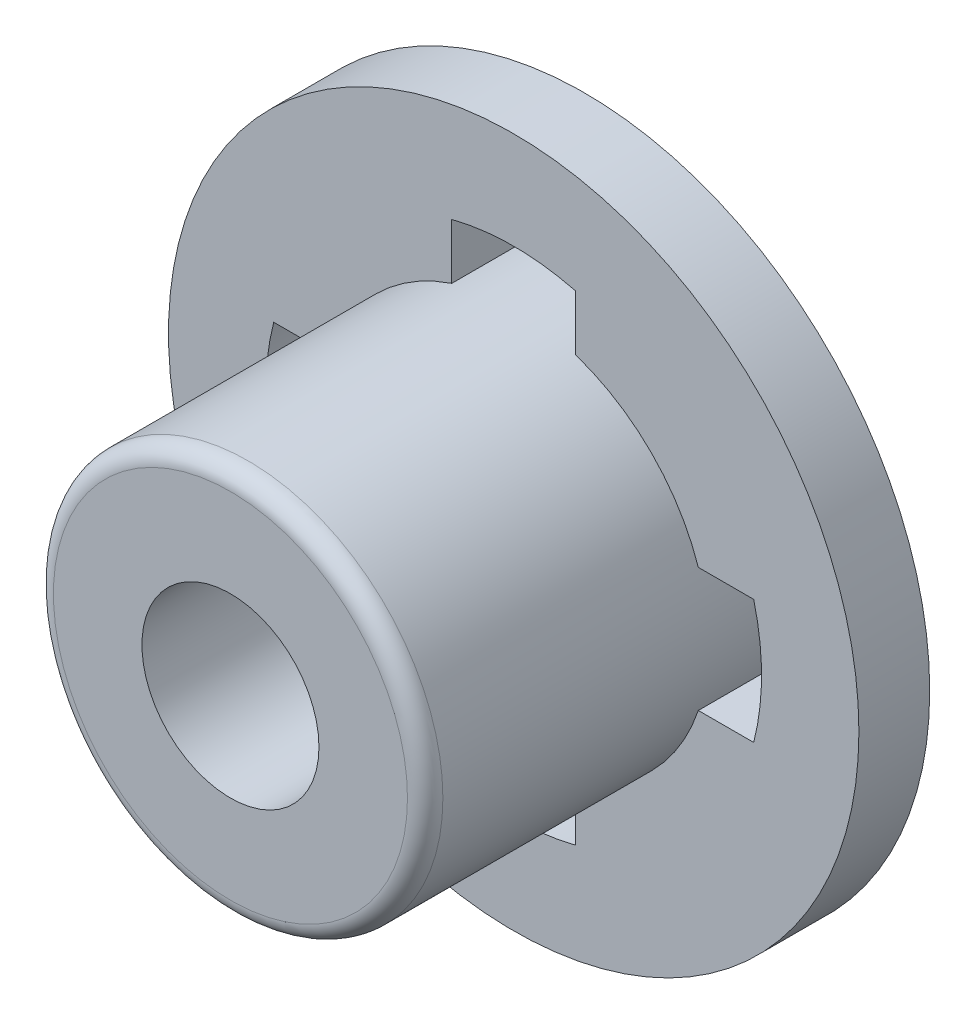
ISO-10303-21;
HEADER;
FILE_DESCRIPTION(('STEP AP214'),'2;1');
FILE_NAME('part.step','',(''),(''),'','','');
FILE_SCHEMA(('AUTOMOTIVE_DESIGN { 1 0 10303 214 1 1 1 1 }'));
ENDSEC;
DATA;
#1=APPLICATION_CONTEXT('core data for automotive mechanical design processes');
#2=APPLICATION_PROTOCOL_DEFINITION('international standard','automotive_design',2000,#1);
#3=PRODUCT_CONTEXT('',#1,'mechanical');
#4=PRODUCT('Part','Part','',(#3));
#5=PRODUCT_RELATED_PRODUCT_CATEGORY('part','',(#4));
#6=PRODUCT_DEFINITION_FORMATION('','',#4);
#7=PRODUCT_DEFINITION_CONTEXT('part definition',#1,'design');
#8=PRODUCT_DEFINITION('design','',#6,#7);
#9=PRODUCT_DEFINITION_SHAPE('','',#8);
#10=(LENGTH_UNIT() NAMED_UNIT(*) SI_UNIT(.MILLI.,.METRE.));
#11=(NAMED_UNIT(*) PLANE_ANGLE_UNIT() SI_UNIT($,.RADIAN.));
#12=(NAMED_UNIT(*) SI_UNIT($,.STERADIAN.) SOLID_ANGLE_UNIT());
#13=UNCERTAINTY_MEASURE_WITH_UNIT(LENGTH_MEASURE(1.E-05),#10,'distance_accuracy_value','');
#14=(GEOMETRIC_REPRESENTATION_CONTEXT(3) GLOBAL_UNCERTAINTY_ASSIGNED_CONTEXT((#13)) GLOBAL_UNIT_ASSIGNED_CONTEXT((#10,
#11,#12)) REPRESENTATION_CONTEXT('',''));
#15=CARTESIAN_POINT('',(0.,0.,0.));
#16=DIRECTION('',(0.,0.,1.));
#17=DIRECTION('',(1.,0.,0.));
#18=AXIS2_PLACEMENT_3D('',#15,#16,#17);
#19=CARTESIAN_POINT('',(0.,0.,-0.8));
#20=DIRECTION('',(0.,0.,1.));
#21=DIRECTION('',(1.,0.,0.));
#22=AXIS2_PLACEMENT_3D('',#19,#20,#21);
#23=PLANE('',#22);
#24=CARTESIAN_POINT('',(0.,0.,-0.8));
#25=DIRECTION('',(0.,0.,-1.));
#26=DIRECTION('',(-1.,0.,0.));
#27=AXIS2_PLACEMENT_3D('',#24,#25,#26);
#28=CIRCLE('',#27,2.2);
#29=CARTESIAN_POINT('',(2.08566536146142,0.7,-0.8));
#30=VERTEX_POINT('',#29);
#31=CARTESIAN_POINT('',(2.08566536146142,-0.7,-0.8));
#32=VERTEX_POINT('',#31);
#33=EDGE_CURVE('E58',#30,#32,#28,.T.);
#34=ORIENTED_EDGE('',*,*,#33,.T.);
#35=DIRECTION('',(-1.,0.,0.));
#36=VECTOR('',#35,1.);
#37=CARTESIAN_POINT('',(0.,-0.7,-0.8));
#38=LINE('',#37,#36);
#39=CARTESIAN_POINT('',(2.71108834234519,-0.7,-0.8));
#40=VERTEX_POINT('',#39);
#41=EDGE_CURVE('E195',#40,#32,#38,.T.);
#42=ORIENTED_EDGE('',*,*,#41,.F.);
#43=CARTESIAN_POINT('',(0.,0.,-0.8));
#44=DIRECTION('',(0.,0.,-1.));
#45=DIRECTION('',(-1.,0.,0.));
#46=AXIS2_PLACEMENT_3D('',#43,#44,#45);
#47=CIRCLE('',#46,2.8);
#48=CARTESIAN_POINT('',(2.71108834234519,0.7,-0.8));
#49=VERTEX_POINT('',#48);
#50=EDGE_CURVE('E192',#49,#40,#47,.T.);
#51=ORIENTED_EDGE('',*,*,#50,.F.);
#52=DIRECTION('',(-1.,0.,0.));
#53=VECTOR('',#52,1.);
#54=CARTESIAN_POINT('',(0.,0.7,-0.8));
#55=LINE('',#54,#53);
#56=EDGE_CURVE('E189',#49,#30,#55,.T.);
#57=ORIENTED_EDGE('',*,*,#56,.T.);
#58=EDGE_LOOP('',(#34,#42,#51,#57));
#59=FACE_BOUND('',#58,.T.);
#60=CARTESIAN_POINT('',(0.,0.,-0.8));
#61=DIRECTION('',(0.,0.,-1.));
#62=DIRECTION('',(-1.,0.,0.));
#63=AXIS2_PLACEMENT_3D('',#60,#61,#62);
#64=CIRCLE('',#63,2.2);
#65=CARTESIAN_POINT('',(-0.7,2.08566536146142,-0.8));
#66=VERTEX_POINT('',#65);
#67=CARTESIAN_POINT('',(0.7,2.08566536146142,-0.8));
#68=VERTEX_POINT('',#67);
#69=EDGE_CURVE('E240',#66,#68,#64,.T.);
#70=ORIENTED_EDGE('',*,*,#69,.T.);
#71=DIRECTION('',(0.,1.,0.));
#72=VECTOR('',#71,1.);
#73=CARTESIAN_POINT('',(0.7,0.,-0.8));
#74=LINE('',#73,#72);
#75=CARTESIAN_POINT('',(0.7,2.71108834234519,-0.8));
#76=VERTEX_POINT('',#75);
#77=EDGE_CURVE('E249',#68,#76,#74,.T.);
#78=ORIENTED_EDGE('',*,*,#77,.T.);
#79=CARTESIAN_POINT('',(0.,0.,-0.8));
#80=DIRECTION('',(0.,0.,-1.));
#81=DIRECTION('',(-1.,0.,0.));
#82=AXIS2_PLACEMENT_3D('',#79,#80,#81);
#83=CIRCLE('',#82,2.8);
#84=CARTESIAN_POINT('',(-0.7,2.71108834234519,-0.8));
#85=VERTEX_POINT('',#84);
#86=EDGE_CURVE('E246',#85,#76,#83,.T.);
#87=ORIENTED_EDGE('',*,*,#86,.F.);
#88=DIRECTION('',(0.,1.,0.));
#89=VECTOR('',#88,1.);
#90=CARTESIAN_POINT('',(-0.7,0.,-0.8));
#91=LINE('',#90,#89);
#92=EDGE_CURVE('E243',#66,#85,#91,.T.);
#93=ORIENTED_EDGE('',*,*,#92,.F.);
#94=EDGE_LOOP('',(#70,#78,#87,#93));
#95=FACE_BOUND('',#94,.T.);
#96=CARTESIAN_POINT('',(0.,0.,-0.8));
#97=DIRECTION('',(0.,0.,-1.));
#98=DIRECTION('',(-1.,0.,0.));
#99=AXIS2_PLACEMENT_3D('',#96,#97,#98);
#100=CIRCLE('',#99,1.15);
#101=CARTESIAN_POINT('',(-1.15,0.,-0.8));
#102=VERTEX_POINT('',#101);
#103=EDGE_CURVE('E264',#102,#102,#100,.T.);
#104=ORIENTED_EDGE('',*,*,#103,.F.);
#105=EDGE_LOOP('',(#104));
#106=FACE_BOUND('',#105,.T.);
#107=CARTESIAN_POINT('',(0.,0.,-0.8));
#108=DIRECTION('',(0.,0.,1.));
#109=DIRECTION('',(1.,0.,0.));
#110=AXIS2_PLACEMENT_3D('',#107,#108,#109);
#111=CIRCLE('',#110,3.9);
#112=CARTESIAN_POINT('',(3.9,0.,-0.8));
#113=VERTEX_POINT('',#112);
#114=EDGE_CURVE('E279',#113,#113,#111,.T.);
#115=ORIENTED_EDGE('',*,*,#114,.F.);
#116=EDGE_LOOP('',(#115));
#117=FACE_BOUND('',#116,.T.);
#118=CARTESIAN_POINT('',(0.,0.,-0.8));
#119=DIRECTION('',(0.,0.,-1.));
#120=DIRECTION('',(-1.,0.,0.));
#121=AXIS2_PLACEMENT_3D('',#118,#119,#120);
#122=CIRCLE('',#121,2.2);
#123=CARTESIAN_POINT('',(-2.08566536146142,-0.7,-0.8));
#124=VERTEX_POINT('',#123);
#125=CARTESIAN_POINT('',(-2.08566536146142,0.7,-0.8));
#126=VERTEX_POINT('',#125);
#127=EDGE_CURVE('E213',#124,#126,#122,.T.);
#128=ORIENTED_EDGE('',*,*,#127,.T.);
#129=DIRECTION('',(-1.,0.,0.));
#130=VECTOR('',#129,1.);
#131=CARTESIAN_POINT('',(0.,0.7,-0.8));
#132=LINE('',#131,#130);
#133=CARTESIAN_POINT('',(-2.71108834234519,0.7,-0.8));
#134=VERTEX_POINT('',#133);
#135=EDGE_CURVE('E222',#126,#134,#132,.T.);
#136=ORIENTED_EDGE('',*,*,#135,.T.);
#137=CARTESIAN_POINT('',(0.,0.,-0.8));
#138=DIRECTION('',(0.,0.,-1.));
#139=DIRECTION('',(-1.,0.,0.));
#140=AXIS2_PLACEMENT_3D('',#137,#138,#139);
#141=CIRCLE('',#140,2.8);
#142=CARTESIAN_POINT('',(-2.71108834234519,-0.7,-0.8));
#143=VERTEX_POINT('',#142);
#144=EDGE_CURVE('E219',#143,#134,#141,.T.);
#145=ORIENTED_EDGE('',*,*,#144,.F.);
#146=DIRECTION('',(-1.,0.,0.));
#147=VECTOR('',#146,1.);
#148=CARTESIAN_POINT('',(0.,-0.7,-0.8));
#149=LINE('',#148,#147);
#150=EDGE_CURVE('E216',#124,#143,#149,.T.);
#151=ORIENTED_EDGE('',*,*,#150,.F.);
#152=EDGE_LOOP('',(#128,#136,#145,#151));
#153=FACE_BOUND('',#152,.T.);
#154=CARTESIAN_POINT('',(0.,0.,-0.8));
#155=DIRECTION('',(0.,0.,-1.));
#156=DIRECTION('',(-1.,0.,0.));
#157=AXIS2_PLACEMENT_3D('',#154,#155,#156);
#158=CIRCLE('',#157,2.2);
#159=CARTESIAN_POINT('',(0.7,-2.08566536146142,-0.8));
#160=VERTEX_POINT('',#159);
#161=CARTESIAN_POINT('',(-0.7,-2.08566536146142,-0.8));
#162=VERTEX_POINT('',#161);
#163=EDGE_CURVE('E51',#160,#162,#158,.T.);
#164=ORIENTED_EDGE('',*,*,#163,.T.);
#165=DIRECTION('',(0.,1.,0.));
#166=VECTOR('',#165,1.);
#167=CARTESIAN_POINT('',(-0.7,0.,-0.8));
#168=LINE('',#167,#166);
#169=CARTESIAN_POINT('',(-0.7,-2.71108834234519,-0.8));
#170=VERTEX_POINT('',#169);
#171=EDGE_CURVE('E169',#170,#162,#168,.T.);
#172=ORIENTED_EDGE('',*,*,#171,.F.);
#173=CARTESIAN_POINT('',(0.,0.,-0.8));
#174=DIRECTION('',(0.,0.,-1.));
#175=DIRECTION('',(-1.,0.,0.));
#176=AXIS2_PLACEMENT_3D('',#173,#174,#175);
#177=CIRCLE('',#176,2.8);
#178=CARTESIAN_POINT('',(0.7,-2.71108834234519,-0.8));
#179=VERTEX_POINT('',#178);
#180=EDGE_CURVE('E154',#179,#170,#177,.T.);
#181=ORIENTED_EDGE('',*,*,#180,.F.);
#182=DIRECTION('',(0.,1.,0.));
#183=VECTOR('',#182,1.);
#184=CARTESIAN_POINT('',(0.7,0.,-0.8));
#185=LINE('',#184,#183);
#186=EDGE_CURVE('E164',#179,#160,#185,.T.);
#187=ORIENTED_EDGE('',*,*,#186,.T.);
#188=EDGE_LOOP('',(#164,#172,#181,#187));
#189=FACE_BOUND('',#188,.T.);
#190=ADVANCED_FACE('F35',(#59,#95,#106,#117,#153,#189),#23,.F.);
#191=CARTESIAN_POINT('',(0.,0.,0.));
#192=DIRECTION('',(0.,0.,1.));
#193=DIRECTION('',(1.,0.,0.));
#194=AXIS2_PLACEMENT_3D('',#191,#192,#193);
#195=PLANE('',#194);
#196=DIRECTION('',(0.,1.,0.));
#197=VECTOR('',#196,1.);
#198=CARTESIAN_POINT('',(-0.7,0.,0.));
#199=LINE('',#198,#197);
#200=CARTESIAN_POINT('',(-0.7,-2.71108834234519,0.));
#201=VERTEX_POINT('',#200);
#202=CARTESIAN_POINT('',(-0.7,-2.08566536146142,0.));
#203=VERTEX_POINT('',#202);
#204=EDGE_CURVE('E342',#201,#203,#199,.T.);
#205=ORIENTED_EDGE('',*,*,#204,.T.);
#206=CARTESIAN_POINT('',(0.,0.,0.));
#207=DIRECTION('',(0.,0.,1.));
#208=DIRECTION('',(1.,0.,0.));
#209=AXIS2_PLACEMENT_3D('',#206,#207,#208);
#210=CIRCLE('',#209,2.2);
#211=CARTESIAN_POINT('',(-2.08566536146142,-0.7,0.));
#212=VERTEX_POINT('',#211);
#213=EDGE_CURVE('E277',#212,#203,#210,.T.);
#214=ORIENTED_EDGE('',*,*,#213,.F.);
#215=DIRECTION('',(-1.,0.,0.));
#216=VECTOR('',#215,1.);
#217=CARTESIAN_POINT('',(0.,-0.7,0.));
#218=LINE('',#217,#216);
#219=CARTESIAN_POINT('',(-2.71108834234519,-0.7,0.));
#220=VERTEX_POINT('',#219);
#221=EDGE_CURVE('E185',#212,#220,#218,.T.);
#222=ORIENTED_EDGE('',*,*,#221,.T.);
#223=CARTESIAN_POINT('',(0.,0.,0.));
#224=DIRECTION('',(0.,0.,1.));
#225=DIRECTION('',(1.,0.,0.));
#226=AXIS2_PLACEMENT_3D('',#223,#224,#225);
#227=CIRCLE('',#226,2.8);
#228=CARTESIAN_POINT('',(-2.71108834234519,0.7,0.));
#229=VERTEX_POINT('',#228);
#230=EDGE_CURVE('E208',#220,#229,#227,.F.);
#231=ORIENTED_EDGE('',*,*,#230,.T.);
#232=DIRECTION('',(-1.,0.,0.));
#233=VECTOR('',#232,1.);
#234=CARTESIAN_POINT('',(0.,0.7,0.));
#235=LINE('',#234,#233);
#236=CARTESIAN_POINT('',(-2.08566536146142,0.7,0.));
#237=VERTEX_POINT('',#236);
#238=EDGE_CURVE('E211',#237,#229,#235,.T.);
#239=ORIENTED_EDGE('',*,*,#238,.F.);
#240=CARTESIAN_POINT('',(-0.7,2.08566536146142,0.));
#241=VERTEX_POINT('',#240);
#242=EDGE_CURVE('E274',#241,#237,#210,.T.);
#243=ORIENTED_EDGE('',*,*,#242,.F.);
#244=DIRECTION('',(0.,1.,0.));
#245=VECTOR('',#244,1.);
#246=CARTESIAN_POINT('',(-0.7,0.,0.));
#247=LINE('',#246,#245);
#248=CARTESIAN_POINT('',(-0.7,2.71108834234519,0.));
#249=VERTEX_POINT('',#248);
#250=EDGE_CURVE('E255',#241,#249,#247,.T.);
#251=ORIENTED_EDGE('',*,*,#250,.T.);
#252=CARTESIAN_POINT('',(0.,0.,0.));
#253=DIRECTION('',(0.,0.,1.));
#254=DIRECTION('',(1.,0.,0.));
#255=AXIS2_PLACEMENT_3D('',#252,#253,#254);
#256=CIRCLE('',#255,2.8);
#257=CARTESIAN_POINT('',(0.7,2.71108834234519,0.));
#258=VERTEX_POINT('',#257);
#259=EDGE_CURVE('E180',#249,#258,#256,.F.);
#260=ORIENTED_EDGE('',*,*,#259,.T.);
#261=DIRECTION('',(0.,1.,0.));
#262=VECTOR('',#261,1.);
#263=CARTESIAN_POINT('',(0.7,0.,0.));
#264=LINE('',#263,#262);
#265=CARTESIAN_POINT('',(0.7,2.08566536146142,0.));
#266=VERTEX_POINT('',#265);
#267=EDGE_CURVE('E238',#266,#258,#264,.T.);
#268=ORIENTED_EDGE('',*,*,#267,.F.);
#269=CARTESIAN_POINT('',(2.08566536146142,0.7,0.));
#270=VERTEX_POINT('',#269);
#271=EDGE_CURVE('E278',#270,#266,#210,.T.);
#272=ORIENTED_EDGE('',*,*,#271,.F.);
#273=DIRECTION('',(-1.,0.,0.));
#274=VECTOR('',#273,1.);
#275=CARTESIAN_POINT('',(0.,0.7,0.));
#276=LINE('',#275,#274);
#277=CARTESIAN_POINT('',(2.71108834234519,0.7,0.));
#278=VERTEX_POINT('',#277);
#279=EDGE_CURVE('E201',#278,#270,#276,.T.);
#280=ORIENTED_EDGE('',*,*,#279,.F.);
#281=CARTESIAN_POINT('',(0.,0.,0.));
#282=DIRECTION('',(0.,0.,1.));
#283=DIRECTION('',(1.,0.,0.));
#284=AXIS2_PLACEMENT_3D('',#281,#282,#283);
#285=CIRCLE('',#284,2.8);
#286=CARTESIAN_POINT('',(2.71108834234519,-0.7,0.));
#287=VERTEX_POINT('',#286);
#288=EDGE_CURVE('E181',#278,#287,#285,.F.);
#289=ORIENTED_EDGE('',*,*,#288,.T.);
#290=DIRECTION('',(-1.,0.,0.));
#291=VECTOR('',#290,1.);
#292=CARTESIAN_POINT('',(0.,-0.7,0.));
#293=LINE('',#292,#291);
#294=CARTESIAN_POINT('',(2.08566536146142,-0.7,0.));
#295=VERTEX_POINT('',#294);
#296=EDGE_CURVE('E184',#287,#295,#293,.T.);
#297=ORIENTED_EDGE('',*,*,#296,.T.);
#298=CARTESIAN_POINT('',(0.7,-2.08566536146142,0.));
#299=VERTEX_POINT('',#298);
#300=EDGE_CURVE('E343',#299,#295,#210,.T.);
#301=ORIENTED_EDGE('',*,*,#300,.F.);
#302=DIRECTION('',(0.,1.,0.));
#303=VECTOR('',#302,1.);
#304=CARTESIAN_POINT('',(0.7,0.,0.));
#305=LINE('',#304,#303);
#306=CARTESIAN_POINT('',(0.7,-2.71108834234519,0.));
#307=VERTEX_POINT('',#306);
#308=EDGE_CURVE('E176',#307,#299,#305,.T.);
#309=ORIENTED_EDGE('',*,*,#308,.F.);
#310=CARTESIAN_POINT('',(0.,0.,0.));
#311=DIRECTION('',(0.,0.,1.));
#312=DIRECTION('',(1.,0.,0.));
#313=AXIS2_PLACEMENT_3D('',#310,#311,#312);
#314=CIRCLE('',#313,2.8);
#315=EDGE_CURVE('E157',#307,#201,#314,.F.);
#316=ORIENTED_EDGE('',*,*,#315,.T.);
#317=EDGE_LOOP('',(#205,#214,#222,#231,#239,#243,#251,#260,#268,#272,#280,#289,#297,#301,#309,#316));
#318=FACE_BOUND('',#317,.T.);
#319=CARTESIAN_POINT('',(0.,0.,0.));
#320=DIRECTION('',(0.,0.,1.));
#321=DIRECTION('',(1.,0.,0.));
#322=AXIS2_PLACEMENT_3D('',#319,#320,#321);
#323=CIRCLE('',#322,3.9);
#324=CARTESIAN_POINT('',(3.9,0.,0.));
#325=VERTEX_POINT('',#324);
#326=EDGE_CURVE('E273',#325,#325,#323,.T.);
#327=ORIENTED_EDGE('',*,*,#326,.T.);
#328=EDGE_LOOP('',(#327));
#329=FACE_BOUND('',#328,.T.);
#330=ADVANCED_FACE('F304',(#318,#329),#195,.T.);
#331=CARTESIAN_POINT('',(0.,0.,-0.8));
#332=DIRECTION('',(0.,0.,1.));
#333=DIRECTION('',(1.,0.,0.));
#334=AXIS2_PLACEMENT_3D('',#331,#332,#333);
#335=CYLINDRICAL_SURFACE('',#334,1.);
#336=CARTESIAN_POINT('',(0.,0.,3.2));
#337=DIRECTION('',(0.,0.,1.));
#338=DIRECTION('',(1.,0.,0.));
#339=AXIS2_PLACEMENT_3D('',#336,#337,#338);
#340=CIRCLE('',#339,1.);
#341=CARTESIAN_POINT('',(1.,0.,3.2));
#342=VERTEX_POINT('',#341);
#343=EDGE_CURVE('E270',#342,#342,#340,.T.);
#344=ORIENTED_EDGE('',*,*,#343,.T.);
#345=EDGE_LOOP('',(#344));
#346=FACE_BOUND('',#345,.T.);
#347=CARTESIAN_POINT('',(0.,0.,-0.3));
#348=DIRECTION('',(0.,0.,-1.));
#349=DIRECTION('',(-1.,0.,0.));
#350=AXIS2_PLACEMENT_3D('',#347,#348,#349);
#351=CIRCLE('',#350,1.);
#352=CARTESIAN_POINT('',(-1.,0.,-0.3));
#353=VERTEX_POINT('',#352);
#354=EDGE_CURVE('E39',#353,#353,#351,.F.);
#355=ORIENTED_EDGE('',*,*,#354,.F.);
#356=EDGE_LOOP('',(#355));
#357=FACE_BOUND('',#356,.T.);
#358=ADVANCED_FACE('F310',(#346,#357),#335,.F.);
#359=CARTESIAN_POINT('',(0.,0.,-0.8));
#360=DIRECTION('',(0.,0.,1.));
#361=DIRECTION('',(1.,0.,0.));
#362=AXIS2_PLACEMENT_3D('',#359,#360,#361);
#363=CYLINDRICAL_SURFACE('',#362,3.9);
#364=ORIENTED_EDGE('',*,*,#114,.T.);
#365=EDGE_LOOP('',(#364));
#366=FACE_BOUND('',#365,.T.);
#367=ORIENTED_EDGE('',*,*,#326,.F.);
#368=EDGE_LOOP('',(#367));
#369=FACE_BOUND('',#368,.T.);
#370=ADVANCED_FACE('F317',(#366,#369),#363,.T.);
#371=CARTESIAN_POINT('',(0.,0.,3.2));
#372=DIRECTION('',(0.,0.,-1.));
#373=DIRECTION('',(-1.,0.,0.));
#374=AXIS2_PLACEMENT_3D('',#371,#372,#373);
#375=CYLINDRICAL_SURFACE('',#374,2.2);
#376=CARTESIAN_POINT('',(0.,0.,3.));
#377=DIRECTION('',(0.,0.,1.));
#378=DIRECTION('',(1.,0.,0.));
#379=AXIS2_PLACEMENT_3D('',#376,#377,#378);
#380=CIRCLE('',#379,2.2);
#381=CARTESIAN_POINT('',(2.2,0.,3.));
#382=VERTEX_POINT('',#381);
#383=EDGE_CURVE('E11',#382,#382,#380,.F.);
#384=ORIENTED_EDGE('',*,*,#383,.T.);
#385=EDGE_LOOP('',(#384));
#386=FACE_BOUND('',#385,.T.);
#387=ORIENTED_EDGE('',*,*,#242,.T.);
#388=DIRECTION('',(0.,0.,-1.));
#389=VECTOR('',#388,1.);
#390=CARTESIAN_POINT('',(-2.08566536146142,0.7,3.201));
#391=LINE('',#390,#389);
#392=EDGE_CURVE('E226',#237,#126,#391,.T.);
#393=ORIENTED_EDGE('',*,*,#392,.T.);
#394=ORIENTED_EDGE('',*,*,#127,.F.);
#395=DIRECTION('',(0.,0.,-1.));
#396=VECTOR('',#395,1.);
#397=CARTESIAN_POINT('',(-2.08566536146142,-0.7,3.201));
#398=LINE('',#397,#396);
#399=EDGE_CURVE('E225',#212,#124,#398,.T.);
#400=ORIENTED_EDGE('',*,*,#399,.F.);
#401=ORIENTED_EDGE('',*,*,#213,.T.);
#402=DIRECTION('',(0.,0.,-1.));
#403=VECTOR('',#402,1.);
#404=CARTESIAN_POINT('',(-0.7,-2.08566536146142,3.201));
#405=LINE('',#404,#403);
#406=EDGE_CURVE('E174',#203,#162,#405,.T.);
#407=ORIENTED_EDGE('',*,*,#406,.T.);
#408=ORIENTED_EDGE('',*,*,#163,.F.);
#409=DIRECTION('',(0.,0.,-1.));
#410=VECTOR('',#409,1.);
#411=CARTESIAN_POINT('',(0.7,-2.08566536146142,3.201));
#412=LINE('',#411,#410);
#413=EDGE_CURVE('E161',#299,#160,#412,.T.);
#414=ORIENTED_EDGE('',*,*,#413,.F.);
#415=ORIENTED_EDGE('',*,*,#300,.T.);
#416=DIRECTION('',(0.,0.,-1.));
#417=VECTOR('',#416,1.);
#418=CARTESIAN_POINT('',(2.08566536146142,-0.7,3.201));
#419=LINE('',#418,#417);
#420=EDGE_CURVE('E199',#295,#32,#419,.T.);
#421=ORIENTED_EDGE('',*,*,#420,.T.);
#422=ORIENTED_EDGE('',*,*,#33,.F.);
#423=DIRECTION('',(0.,0.,-1.));
#424=VECTOR('',#423,1.);
#425=CARTESIAN_POINT('',(2.08566536146142,0.7,3.201));
#426=LINE('',#425,#424);
#427=EDGE_CURVE('E198',#270,#30,#426,.T.);
#428=ORIENTED_EDGE('',*,*,#427,.F.);
#429=ORIENTED_EDGE('',*,*,#271,.T.);
#430=DIRECTION('',(0.,0.,-1.));
#431=VECTOR('',#430,1.);
#432=CARTESIAN_POINT('',(0.7,2.08566536146142,3.201));
#433=LINE('',#432,#431);
#434=EDGE_CURVE('E253',#266,#68,#433,.T.);
#435=ORIENTED_EDGE('',*,*,#434,.T.);
#436=ORIENTED_EDGE('',*,*,#69,.F.);
#437=DIRECTION('',(0.,0.,-1.));
#438=VECTOR('',#437,1.);
#439=CARTESIAN_POINT('',(-0.7,2.08566536146142,3.201));
#440=LINE('',#439,#438);
#441=EDGE_CURVE('E252',#241,#66,#440,.T.);
#442=ORIENTED_EDGE('',*,*,#441,.F.);
#443=EDGE_LOOP('',(#387,#393,#394,#400,#401,#407,#408,#414,#415,#421,#422,#428,#429,#435,#436,#442));
#444=FACE_BOUND('',#443,.T.);
#445=ADVANCED_FACE('F300',(#386,#444),#375,.T.);
#446=CARTESIAN_POINT('',(0.,0.,3.2));
#447=DIRECTION('',(0.,0.,1.));
#448=DIRECTION('',(1.,0.,0.));
#449=AXIS2_PLACEMENT_3D('',#446,#447,#448);
#450=PLANE('',#449);
#451=CARTESIAN_POINT('',(0.,0.,3.2));
#452=DIRECTION('',(0.,0.,1.));
#453=DIRECTION('',(1.,0.,0.));
#454=AXIS2_PLACEMENT_3D('',#451,#452,#453);
#455=CIRCLE('',#454,2.);
#456=CARTESIAN_POINT('',(2.,0.,3.2));
#457=VERTEX_POINT('',#456);
#458=EDGE_CURVE('E44',#457,#457,#455,.T.);
#459=ORIENTED_EDGE('',*,*,#458,.T.);
#460=EDGE_LOOP('',(#459));
#461=FACE_BOUND('',#460,.T.);
#462=ORIENTED_EDGE('',*,*,#343,.F.);
#463=EDGE_LOOP('',(#462));
#464=FACE_BOUND('',#463,.T.);
#465=ADVANCED_FACE('F287',(#461,#464),#450,.T.);
#466=CARTESIAN_POINT('',(0.,0.,3.));
#467=DIRECTION('',(0.,0.,1.));
#468=DIRECTION('',(1.,0.,0.));
#469=AXIS2_PLACEMENT_3D('',#466,#467,#468);
#470=TOROIDAL_SURFACE('',#469,2.,0.2);
#471=ORIENTED_EDGE('',*,*,#383,.F.);
#472=EDGE_LOOP('',(#471));
#473=FACE_BOUND('',#472,.T.);
#474=ORIENTED_EDGE('',*,*,#458,.F.);
#475=EDGE_LOOP('',(#474));
#476=FACE_BOUND('',#475,.T.);
#477=ADVANCED_FACE('F37',(#473,#476),#470,.T.);
#478=CARTESIAN_POINT('',(0.,0.,-0.3));
#479=DIRECTION('',(0.,0.,-1.));
#480=DIRECTION('',(-1.,0.,0.));
#481=AXIS2_PLACEMENT_3D('',#478,#479,#480);
#482=PLANE('',#481);
#483=CARTESIAN_POINT('',(0.,0.,-0.3));
#484=DIRECTION('',(0.,0.,-1.));
#485=DIRECTION('',(-1.,0.,0.));
#486=AXIS2_PLACEMENT_3D('',#483,#484,#485);
#487=CIRCLE('',#486,1.15);
#488=CARTESIAN_POINT('',(-1.15,0.,-0.3));
#489=VERTEX_POINT('',#488);
#490=EDGE_CURVE('E265',#489,#489,#487,.T.);
#491=ORIENTED_EDGE('',*,*,#490,.T.);
#492=EDGE_LOOP('',(#491));
#493=FACE_BOUND('',#492,.T.);
#494=ORIENTED_EDGE('',*,*,#354,.T.);
#495=EDGE_LOOP('',(#494));
#496=FACE_BOUND('',#495,.T.);
#497=ADVANCED_FACE('F291',(#493,#496),#482,.T.);
#498=CARTESIAN_POINT('',(0.,0.,-0.3));
#499=DIRECTION('',(0.,0.,-1.));
#500=DIRECTION('',(-1.,0.,0.));
#501=AXIS2_PLACEMENT_3D('',#498,#499,#500);
#502=CYLINDRICAL_SURFACE('',#501,1.15);
#503=ORIENTED_EDGE('',*,*,#490,.F.);
#504=EDGE_LOOP('',(#503));
#505=FACE_BOUND('',#504,.T.);
#506=ORIENTED_EDGE('',*,*,#103,.T.);
#507=EDGE_LOOP('',(#506));
#508=FACE_BOUND('',#507,.T.);
#509=ADVANCED_FACE('F297',(#505,#508),#502,.F.);
#510=CARTESIAN_POINT('',(0.7,0.,3.201));
#511=DIRECTION('',(-1.,0.,0.));
#512=DIRECTION('',(0.,0.,1.));
#513=AXIS2_PLACEMENT_3D('',#510,#511,#512);
#514=PLANE('',#513);
#515=ORIENTED_EDGE('',*,*,#267,.T.);
#516=DIRECTION('',(0.,0.,-1.));
#517=VECTOR('',#516,1.);
#518=CARTESIAN_POINT('',(0.7,2.71108834234519,3.201));
#519=LINE('',#518,#517);
#520=EDGE_CURVE('E256',#258,#76,#519,.T.);
#521=ORIENTED_EDGE('',*,*,#520,.T.);
#522=ORIENTED_EDGE('',*,*,#77,.F.);
#523=ORIENTED_EDGE('',*,*,#434,.F.);
#524=EDGE_LOOP('',(#515,#521,#522,#523));
#525=FACE_BOUND('',#524,.T.);
#526=ADVANCED_FACE('F356',(#525),#514,.T.);
#527=CARTESIAN_POINT('',(0.,0.,3.201));
#528=DIRECTION('',(0.,0.,-1.));
#529=DIRECTION('',(-1.,0.,0.));
#530=AXIS2_PLACEMENT_3D('',#527,#528,#529);
#531=CYLINDRICAL_SURFACE('',#530,2.8);
#532=DIRECTION('',(0.,0.,-1.));
#533=VECTOR('',#532,1.);
#534=CARTESIAN_POINT('',(-0.7,2.71108834234519,3.201));
#535=LINE('',#534,#533);
#536=EDGE_CURVE('E258',#249,#85,#535,.T.);
#537=ORIENTED_EDGE('',*,*,#536,.T.);
#538=ORIENTED_EDGE('',*,*,#86,.T.);
#539=ORIENTED_EDGE('',*,*,#520,.F.);
#540=ORIENTED_EDGE('',*,*,#259,.F.);
#541=EDGE_LOOP('',(#537,#538,#539,#540));
#542=FACE_BOUND('',#541,.T.);
#543=ADVANCED_FACE('F362',(#542),#531,.F.);
#544=CARTESIAN_POINT('',(-0.7,0.,3.201));
#545=DIRECTION('',(-1.,0.,0.));
#546=DIRECTION('',(0.,0.,1.));
#547=AXIS2_PLACEMENT_3D('',#544,#545,#546);
#548=PLANE('',#547);
#549=ORIENTED_EDGE('',*,*,#441,.T.);
#550=ORIENTED_EDGE('',*,*,#92,.T.);
#551=ORIENTED_EDGE('',*,*,#536,.F.);
#552=ORIENTED_EDGE('',*,*,#250,.F.);
#553=EDGE_LOOP('',(#549,#550,#551,#552));
#554=FACE_BOUND('',#553,.T.);
#555=ADVANCED_FACE('F364',(#554),#548,.F.);
#556=CARTESIAN_POINT('',(0.,0.7,3.201));
#557=DIRECTION('',(0.,-1.,0.));
#558=DIRECTION('',(0.,0.,-1.));
#559=AXIS2_PLACEMENT_3D('',#556,#557,#558);
#560=PLANE('',#559);
#561=ORIENTED_EDGE('',*,*,#238,.T.);
#562=DIRECTION('',(0.,0.,-1.));
#563=VECTOR('',#562,1.);
#564=CARTESIAN_POINT('',(-2.71108834234519,0.7,3.201));
#565=LINE('',#564,#563);
#566=EDGE_CURVE('E228',#229,#134,#565,.T.);
#567=ORIENTED_EDGE('',*,*,#566,.T.);
#568=ORIENTED_EDGE('',*,*,#135,.F.);
#569=ORIENTED_EDGE('',*,*,#392,.F.);
#570=EDGE_LOOP('',(#561,#567,#568,#569));
#571=FACE_BOUND('',#570,.T.);
#572=ADVANCED_FACE('F371',(#571),#560,.T.);
#573=CARTESIAN_POINT('',(0.,0.,3.201));
#574=DIRECTION('',(0.,0.,-1.));
#575=DIRECTION('',(-1.,0.,0.));
#576=AXIS2_PLACEMENT_3D('',#573,#574,#575);
#577=CYLINDRICAL_SURFACE('',#576,2.8);
#578=DIRECTION('',(0.,0.,-1.));
#579=VECTOR('',#578,1.);
#580=CARTESIAN_POINT('',(-2.71108834234519,-0.7,3.201));
#581=LINE('',#580,#579);
#582=EDGE_CURVE('E230',#220,#143,#581,.T.);
#583=ORIENTED_EDGE('',*,*,#582,.T.);
#584=ORIENTED_EDGE('',*,*,#144,.T.);
#585=ORIENTED_EDGE('',*,*,#566,.F.);
#586=ORIENTED_EDGE('',*,*,#230,.F.);
#587=EDGE_LOOP('',(#583,#584,#585,#586));
#588=FACE_BOUND('',#587,.T.);
#589=ADVANCED_FACE('F373',(#588),#577,.F.);
#590=CARTESIAN_POINT('',(0.,-0.7,3.201));
#591=DIRECTION('',(0.,-1.,0.));
#592=DIRECTION('',(0.,0.,-1.));
#593=AXIS2_PLACEMENT_3D('',#590,#591,#592);
#594=PLANE('',#593);
#595=ORIENTED_EDGE('',*,*,#399,.T.);
#596=ORIENTED_EDGE('',*,*,#150,.T.);
#597=ORIENTED_EDGE('',*,*,#582,.F.);
#598=ORIENTED_EDGE('',*,*,#221,.F.);
#599=EDGE_LOOP('',(#595,#596,#597,#598));
#600=FACE_BOUND('',#599,.T.);
#601=ADVANCED_FACE('F337',(#600),#594,.F.);
#602=CARTESIAN_POINT('',(0.,-0.7,3.201));
#603=DIRECTION('',(0.,-1.,0.));
#604=DIRECTION('',(0.,0.,-1.));
#605=AXIS2_PLACEMENT_3D('',#602,#603,#604);
#606=PLANE('',#605);
#607=DIRECTION('',(0.,0.,-1.));
#608=VECTOR('',#607,1.);
#609=CARTESIAN_POINT('',(2.71108834234519,-0.7,3.201));
#610=LINE('',#609,#608);
#611=EDGE_CURVE('E202',#287,#40,#610,.T.);
#612=ORIENTED_EDGE('',*,*,#611,.T.);
#613=ORIENTED_EDGE('',*,*,#41,.T.);
#614=ORIENTED_EDGE('',*,*,#420,.F.);
#615=ORIENTED_EDGE('',*,*,#296,.F.);
#616=EDGE_LOOP('',(#612,#613,#614,#615));
#617=FACE_BOUND('',#616,.T.);
#618=ADVANCED_FACE('F380',(#617),#606,.F.);
#619=CARTESIAN_POINT('',(0.,0.,3.201));
#620=DIRECTION('',(0.,0.,-1.));
#621=DIRECTION('',(-1.,0.,0.));
#622=AXIS2_PLACEMENT_3D('',#619,#620,#621);
#623=CYLINDRICAL_SURFACE('',#622,2.8);
#624=DIRECTION('',(0.,0.,-1.));
#625=VECTOR('',#624,1.);
#626=CARTESIAN_POINT('',(2.71108834234519,0.7,3.201));
#627=LINE('',#626,#625);
#628=EDGE_CURVE('E204',#278,#49,#627,.T.);
#629=ORIENTED_EDGE('',*,*,#628,.T.);
#630=ORIENTED_EDGE('',*,*,#50,.T.);
#631=ORIENTED_EDGE('',*,*,#611,.F.);
#632=ORIENTED_EDGE('',*,*,#288,.F.);
#633=EDGE_LOOP('',(#629,#630,#631,#632));
#634=FACE_BOUND('',#633,.T.);
#635=ADVANCED_FACE('F436',(#634),#623,.F.);
#636=CARTESIAN_POINT('',(0.,0.7,3.201));
#637=DIRECTION('',(0.,-1.,0.));
#638=DIRECTION('',(0.,0.,-1.));
#639=AXIS2_PLACEMENT_3D('',#636,#637,#638);
#640=PLANE('',#639);
#641=ORIENTED_EDGE('',*,*,#279,.T.);
#642=ORIENTED_EDGE('',*,*,#427,.T.);
#643=ORIENTED_EDGE('',*,*,#56,.F.);
#644=ORIENTED_EDGE('',*,*,#628,.F.);
#645=EDGE_LOOP('',(#641,#642,#643,#644));
#646=FACE_BOUND('',#645,.T.);
#647=ADVANCED_FACE('F446',(#646),#640,.T.);
#648=CARTESIAN_POINT('',(-0.7,0.,3.201));
#649=DIRECTION('',(-1.,0.,0.));
#650=DIRECTION('',(0.,0.,1.));
#651=AXIS2_PLACEMENT_3D('',#648,#649,#650);
#652=PLANE('',#651);
#653=DIRECTION('',(0.,0.,-1.));
#654=VECTOR('',#653,1.);
#655=CARTESIAN_POINT('',(-0.7,-2.71108834234519,3.201));
#656=LINE('',#655,#654);
#657=EDGE_CURVE('E160',#201,#170,#656,.T.);
#658=ORIENTED_EDGE('',*,*,#657,.T.);
#659=ORIENTED_EDGE('',*,*,#171,.T.);
#660=ORIENTED_EDGE('',*,*,#406,.F.);
#661=ORIENTED_EDGE('',*,*,#204,.F.);
#662=EDGE_LOOP('',(#658,#659,#660,#661));
#663=FACE_BOUND('',#662,.T.);
#664=ADVANCED_FACE('F456',(#663),#652,.F.);
#665=CARTESIAN_POINT('',(0.,0.,3.201));
#666=DIRECTION('',(0.,0.,-1.));
#667=DIRECTION('',(-1.,0.,0.));
#668=AXIS2_PLACEMENT_3D('',#665,#666,#667);
#669=CYLINDRICAL_SURFACE('',#668,2.8);
#670=DIRECTION('',(0.,0.,-1.));
#671=VECTOR('',#670,1.);
#672=CARTESIAN_POINT('',(0.7,-2.71108834234519,3.201));
#673=LINE('',#672,#671);
#674=EDGE_CURVE('E150',#307,#179,#673,.T.);
#675=ORIENTED_EDGE('',*,*,#674,.T.);
#676=ORIENTED_EDGE('',*,*,#180,.T.);
#677=ORIENTED_EDGE('',*,*,#657,.F.);
#678=ORIENTED_EDGE('',*,*,#315,.F.);
#679=EDGE_LOOP('',(#675,#676,#677,#678));
#680=FACE_BOUND('',#679,.T.);
#681=ADVANCED_FACE('F152',(#680),#669,.F.);
#682=CARTESIAN_POINT('',(0.7,0.,3.201));
#683=DIRECTION('',(-1.,0.,0.));
#684=DIRECTION('',(0.,0.,1.));
#685=AXIS2_PLACEMENT_3D('',#682,#683,#684);
#686=PLANE('',#685);
#687=ORIENTED_EDGE('',*,*,#308,.T.);
#688=ORIENTED_EDGE('',*,*,#413,.T.);
#689=ORIENTED_EDGE('',*,*,#186,.F.);
#690=ORIENTED_EDGE('',*,*,#674,.F.);
#691=EDGE_LOOP('',(#687,#688,#689,#690));
#692=FACE_BOUND('',#691,.T.);
#693=ADVANCED_FACE('F165',(#692),#686,.T.);
#694=CLOSED_SHELL('',(#190,#330,#358,#370,#445,#465,#477,#497,#509,#526,#543,#555,#572,#589,
#601,#618,#635,#647,#664,#681,#693));
#695=MANIFOLD_SOLID_BREP('B2',#694);
#696=ADVANCED_BREP_SHAPE_REPRESENTATION('',(#18,#695),#14);
#697=SHAPE_DEFINITION_REPRESENTATION(#9,#696);
ENDSEC;
END-ISO-10303-21;
